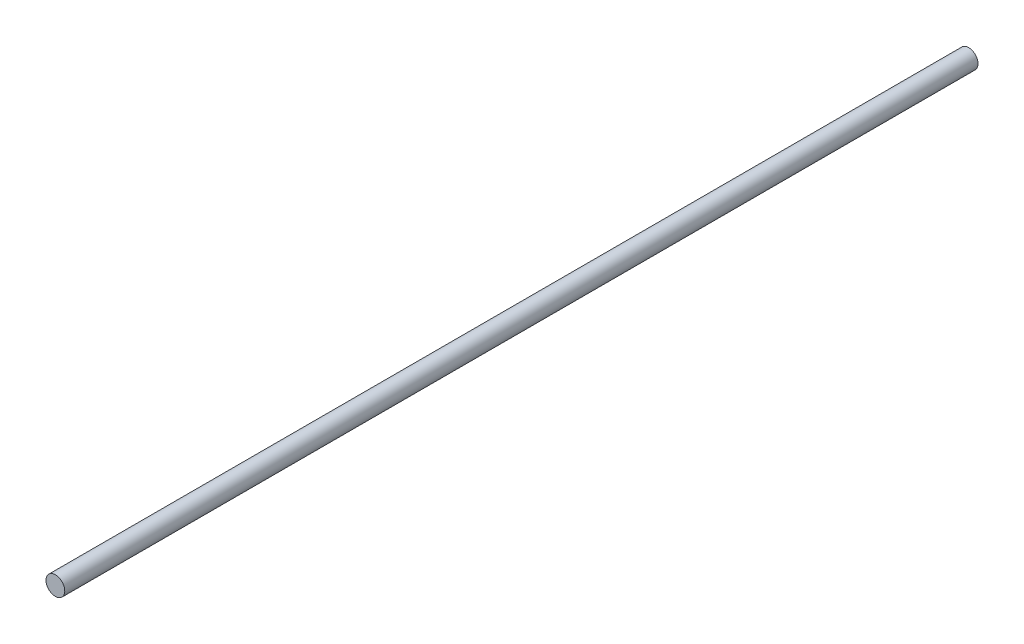
ISO-10303-21;
HEADER;
FILE_DESCRIPTION(('STEP AP214'),'2;1');
FILE_NAME('part.step','',(''),(''),'','','');
FILE_SCHEMA(('AUTOMOTIVE_DESIGN { 1 0 10303 214 1 1 1 1 }'));
ENDSEC;
DATA;
#1=APPLICATION_CONTEXT('core data for automotive mechanical design processes');
#2=APPLICATION_PROTOCOL_DEFINITION('international standard','automotive_design',2000,#1);
#3=PRODUCT_CONTEXT('',#1,'mechanical');
#4=PRODUCT('Part','Part','',(#3));
#5=PRODUCT_RELATED_PRODUCT_CATEGORY('part','',(#4));
#6=PRODUCT_DEFINITION_FORMATION('','',#4);
#7=PRODUCT_DEFINITION_CONTEXT('part definition',#1,'design');
#8=PRODUCT_DEFINITION('design','',#6,#7);
#9=PRODUCT_DEFINITION_SHAPE('','',#8);
#10=(LENGTH_UNIT() NAMED_UNIT(*) SI_UNIT(.MILLI.,.METRE.));
#11=(NAMED_UNIT(*) PLANE_ANGLE_UNIT() SI_UNIT($,.RADIAN.));
#12=(NAMED_UNIT(*) SI_UNIT($,.STERADIAN.) SOLID_ANGLE_UNIT());
#13=UNCERTAINTY_MEASURE_WITH_UNIT(LENGTH_MEASURE(1.E-05),#10,'distance_accuracy_value','');
#14=(GEOMETRIC_REPRESENTATION_CONTEXT(3) GLOBAL_UNCERTAINTY_ASSIGNED_CONTEXT((#13)) GLOBAL_UNIT_ASSIGNED_CONTEXT((#10,
#11,#12)) REPRESENTATION_CONTEXT('',''));
#15=CARTESIAN_POINT('',(0.,0.,0.));
#16=DIRECTION('',(0.,0.,1.));
#17=DIRECTION('',(1.,0.,0.));
#18=AXIS2_PLACEMENT_3D('',#15,#16,#17);
#19=CARTESIAN_POINT('',(0.,0.,0.));
#20=DIRECTION('',(0.,0.,1.));
#21=DIRECTION('',(0.,-1.,0.));
#22=AXIS2_PLACEMENT_3D('',#19,#20,#21);
#23=PLANE('',#22);
#24=CARTESIAN_POINT('',(0.,0.,0.));
#25=DIRECTION('',(0.,0.,-1.));
#26=DIRECTION('',(0.,1.,0.));
#27=AXIS2_PLACEMENT_3D('',#24,#25,#26);
#28=CIRCLE('',#27,4.);
#29=CARTESIAN_POINT('',(0.,4.,0.));
#30=VERTEX_POINT('',#29);
#31=EDGE_CURVE('E10',#30,#30,#28,.T.);
#32=ORIENTED_EDGE('',*,*,#31,.F.);
#33=EDGE_LOOP('',(#32));
#34=FACE_BOUND('',#33,.T.);
#35=ADVANCED_FACE('F35',(#34),#23,.T.);
#36=CARTESIAN_POINT('',(0.,0.,0.));
#37=DIRECTION('',(0.,0.,-1.));
#38=DIRECTION('',(0.,1.,0.));
#39=AXIS2_PLACEMENT_3D('',#36,#37,#38);
#40=CYLINDRICAL_SURFACE('',#39,4.00000000000001);
#41=ORIENTED_EDGE('',*,*,#31,.T.);
#42=EDGE_LOOP('',(#41));
#43=FACE_BOUND('',#42,.T.);
#44=CARTESIAN_POINT('',(0.,0.,-389.2));
#45=DIRECTION('',(0.,0.,-1.));
#46=DIRECTION('',(0.,1.,0.));
#47=AXIS2_PLACEMENT_3D('',#44,#45,#46);
#48=CIRCLE('',#47,4.00000000000002);
#49=CARTESIAN_POINT('',(0.,4.,-389.2));
#50=VERTEX_POINT('',#49);
#51=EDGE_CURVE('E42',#50,#50,#48,.T.);
#52=ORIENTED_EDGE('',*,*,#51,.F.);
#53=EDGE_LOOP('',(#52));
#54=FACE_BOUND('',#53,.T.);
#55=ADVANCED_FACE('F50',(#43,#54),#40,.T.);
#56=CARTESIAN_POINT('',(0.,0.,-389.2));
#57=DIRECTION('',(0.,0.,-1.));
#58=DIRECTION('',(0.,1.,0.));
#59=AXIS2_PLACEMENT_3D('',#56,#57,#58);
#60=PLANE('',#59);
#61=ORIENTED_EDGE('',*,*,#51,.T.);
#62=EDGE_LOOP('',(#61));
#63=FACE_BOUND('',#62,.T.);
#64=ADVANCED_FACE('F48',(#63),#60,.T.);
#65=CLOSED_SHELL('',(#35,#55,#64));
#66=MANIFOLD_SOLID_BREP('B2',#65);
#67=ADVANCED_BREP_SHAPE_REPRESENTATION('',(#18,#66),#14);
#68=SHAPE_DEFINITION_REPRESENTATION(#9,#67);
ENDSEC;
END-ISO-10303-21;
